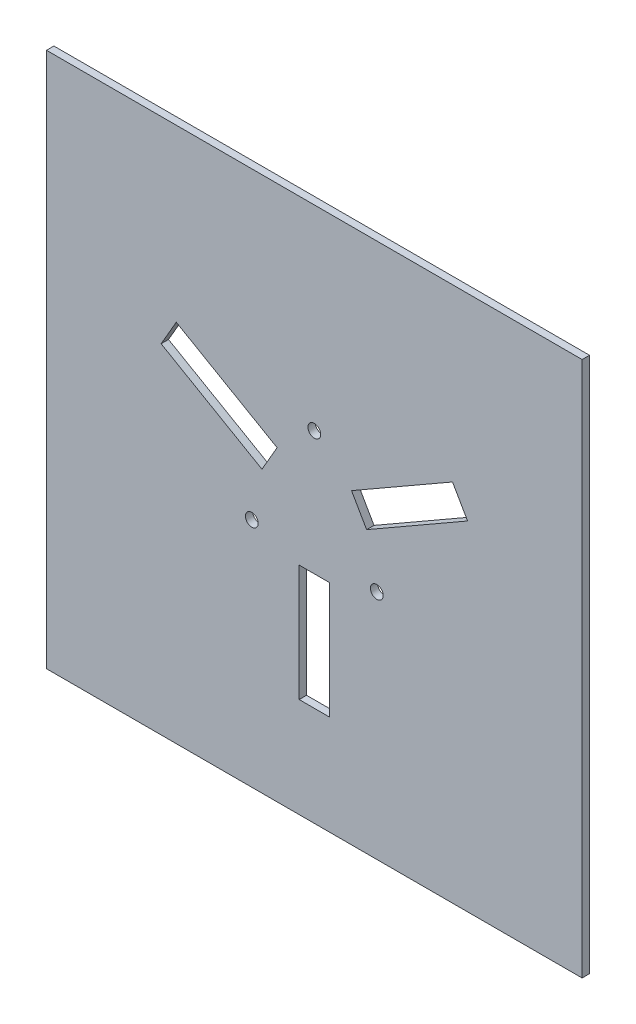
ISO-10303-21;
HEADER;
FILE_DESCRIPTION(('STEP AP214'),'2;1');
FILE_NAME('part.step','',(''),(''),'','','');
FILE_SCHEMA(('AUTOMOTIVE_DESIGN { 1 0 10303 214 1 1 1 1 }'));
ENDSEC;
DATA;
#1=APPLICATION_CONTEXT('core data for automotive mechanical design processes');
#2=APPLICATION_PROTOCOL_DEFINITION('international standard','automotive_design',2000,#1);
#3=PRODUCT_CONTEXT('',#1,'mechanical');
#4=PRODUCT('Part','Part','',(#3));
#5=PRODUCT_RELATED_PRODUCT_CATEGORY('part','',(#4));
#6=PRODUCT_DEFINITION_FORMATION('','',#4);
#7=PRODUCT_DEFINITION_CONTEXT('part definition',#1,'design');
#8=PRODUCT_DEFINITION('design','',#6,#7);
#9=PRODUCT_DEFINITION_SHAPE('','',#8);
#10=(LENGTH_UNIT() NAMED_UNIT(*) SI_UNIT(.MILLI.,.METRE.));
#11=(NAMED_UNIT(*) PLANE_ANGLE_UNIT() SI_UNIT($,.RADIAN.));
#12=(NAMED_UNIT(*) SI_UNIT($,.STERADIAN.) SOLID_ANGLE_UNIT());
#13=UNCERTAINTY_MEASURE_WITH_UNIT(LENGTH_MEASURE(1.E-05),#10,'distance_accuracy_value','');
#14=(GEOMETRIC_REPRESENTATION_CONTEXT(3) GLOBAL_UNCERTAINTY_ASSIGNED_CONTEXT((#13)) GLOBAL_UNIT_ASSIGNED_CONTEXT((#10,
#11,#12)) REPRESENTATION_CONTEXT('',''));
#15=CARTESIAN_POINT('',(0.,0.,0.));
#16=DIRECTION('',(0.,0.,1.));
#17=DIRECTION('',(1.,0.,0.));
#18=AXIS2_PLACEMENT_3D('',#15,#16,#17);
#19=CARTESIAN_POINT('',(115.,115.,0.));
#20=DIRECTION('',(0.,1.,0.));
#21=DIRECTION('',(0.,0.,1.));
#22=AXIS2_PLACEMENT_3D('',#19,#20,#21);
#23=PLANE('',#22);
#24=DIRECTION('',(-1.,0.,0.));
#25=VECTOR('',#24,1.);
#26=CARTESIAN_POINT('',(115.,115.,3.175));
#27=LINE('',#26,#25);
#28=CARTESIAN_POINT('',(115.,115.,3.175));
#29=VERTEX_POINT('',#28);
#30=CARTESIAN_POINT('',(-115.,115.,3.175));
#31=VERTEX_POINT('',#30);
#32=EDGE_CURVE('E260',#29,#31,#27,.T.);
#33=ORIENTED_EDGE('',*,*,#32,.F.);
#34=DIRECTION('',(0.,0.,1.));
#35=VECTOR('',#34,1.);
#36=CARTESIAN_POINT('',(115.,115.,0.));
#37=LINE('',#36,#35);
#38=CARTESIAN_POINT('',(115.,115.,0.));
#39=VERTEX_POINT('',#38);
#40=EDGE_CURVE('E11',#39,#29,#37,.T.);
#41=ORIENTED_EDGE('',*,*,#40,.F.);
#42=DIRECTION('',(-1.,0.,0.));
#43=VECTOR('',#42,1.);
#44=CARTESIAN_POINT('',(115.,115.,0.));
#45=LINE('',#44,#43);
#46=CARTESIAN_POINT('',(-115.,115.,0.));
#47=VERTEX_POINT('',#46);
#48=EDGE_CURVE('E267',#39,#47,#45,.T.);
#49=ORIENTED_EDGE('',*,*,#48,.T.);
#50=DIRECTION('',(0.,0.,1.));
#51=VECTOR('',#50,1.);
#52=CARTESIAN_POINT('',(-115.,115.,0.));
#53=LINE('',#52,#51);
#54=EDGE_CURVE('E38',#47,#31,#53,.T.);
#55=ORIENTED_EDGE('',*,*,#54,.T.);
#56=EDGE_LOOP('',(#33,#41,#49,#55));
#57=FACE_BOUND('',#56,.T.);
#58=ADVANCED_FACE('F35',(#57),#23,.T.);
#59=CARTESIAN_POINT('',(115.,-115.,0.));
#60=DIRECTION('',(1.,0.,0.));
#61=DIRECTION('',(0.,0.,-1.));
#62=AXIS2_PLACEMENT_3D('',#59,#60,#61);
#63=PLANE('',#62);
#64=DIRECTION('',(0.,1.,0.));
#65=VECTOR('',#64,1.);
#66=CARTESIAN_POINT('',(115.,-115.,3.175));
#67=LINE('',#66,#65);
#68=CARTESIAN_POINT('',(115.,-115.,3.175));
#69=VERTEX_POINT('',#68);
#70=EDGE_CURVE('E271',#69,#29,#67,.T.);
#71=ORIENTED_EDGE('',*,*,#70,.F.);
#72=DIRECTION('',(0.,0.,1.));
#73=VECTOR('',#72,1.);
#74=CARTESIAN_POINT('',(115.,-115.,0.));
#75=LINE('',#74,#73);
#76=CARTESIAN_POINT('',(115.,-115.,0.));
#77=VERTEX_POINT('',#76);
#78=EDGE_CURVE('E43',#77,#69,#75,.T.);
#79=ORIENTED_EDGE('',*,*,#78,.F.);
#80=DIRECTION('',(0.,1.,0.));
#81=VECTOR('',#80,1.);
#82=CARTESIAN_POINT('',(115.,-115.,0.));
#83=LINE('',#82,#81);
#84=EDGE_CURVE('E277',#77,#39,#83,.T.);
#85=ORIENTED_EDGE('',*,*,#84,.T.);
#86=ORIENTED_EDGE('',*,*,#40,.T.);
#87=EDGE_LOOP('',(#71,#79,#85,#86));
#88=FACE_BOUND('',#87,.T.);
#89=ADVANCED_FACE('F303',(#88),#63,.T.);
#90=CARTESIAN_POINT('',(-115.,-115.,0.));
#91=DIRECTION('',(0.,-1.,0.));
#92=DIRECTION('',(0.,0.,-1.));
#93=AXIS2_PLACEMENT_3D('',#90,#91,#92);
#94=PLANE('',#93);
#95=DIRECTION('',(1.,0.,0.));
#96=VECTOR('',#95,1.);
#97=CARTESIAN_POINT('',(-115.,-115.,3.175));
#98=LINE('',#97,#96);
#99=CARTESIAN_POINT('',(-115.,-115.,3.175));
#100=VERTEX_POINT('',#99);
#101=EDGE_CURVE('E285',#100,#69,#98,.T.);
#102=ORIENTED_EDGE('',*,*,#101,.F.);
#103=DIRECTION('',(0.,0.,1.));
#104=VECTOR('',#103,1.);
#105=CARTESIAN_POINT('',(-115.,-115.,0.));
#106=LINE('',#105,#104);
#107=CARTESIAN_POINT('',(-115.,-115.,0.));
#108=VERTEX_POINT('',#107);
#109=EDGE_CURVE('E290',#108,#100,#106,.T.);
#110=ORIENTED_EDGE('',*,*,#109,.F.);
#111=DIRECTION('',(1.,0.,0.));
#112=VECTOR('',#111,1.);
#113=CARTESIAN_POINT('',(-115.,-115.,0.));
#114=LINE('',#113,#112);
#115=EDGE_CURVE('E274',#108,#77,#114,.T.);
#116=ORIENTED_EDGE('',*,*,#115,.T.);
#117=ORIENTED_EDGE('',*,*,#78,.T.);
#118=EDGE_LOOP('',(#102,#110,#116,#117));
#119=FACE_BOUND('',#118,.T.);
#120=ADVANCED_FACE('F308',(#119),#94,.T.);
#121=CARTESIAN_POINT('',(-115.,115.,0.));
#122=DIRECTION('',(-1.,0.,0.));
#123=DIRECTION('',(0.,0.,1.));
#124=AXIS2_PLACEMENT_3D('',#121,#122,#123);
#125=PLANE('',#124);
#126=DIRECTION('',(0.,-1.,0.));
#127=VECTOR('',#126,1.);
#128=CARTESIAN_POINT('',(-115.,115.,3.175));
#129=LINE('',#128,#127);
#130=EDGE_CURVE('E282',#31,#100,#129,.T.);
#131=ORIENTED_EDGE('',*,*,#130,.F.);
#132=ORIENTED_EDGE('',*,*,#54,.F.);
#133=DIRECTION('',(0.,-1.,0.));
#134=VECTOR('',#133,1.);
#135=CARTESIAN_POINT('',(-115.,115.,0.));
#136=LINE('',#135,#134);
#137=EDGE_CURVE('E270',#47,#108,#136,.T.);
#138=ORIENTED_EDGE('',*,*,#137,.T.);
#139=ORIENTED_EDGE('',*,*,#109,.T.);
#140=EDGE_LOOP('',(#131,#132,#138,#139));
#141=FACE_BOUND('',#140,.T.);
#142=ADVANCED_FACE('F298',(#141),#125,.T.);
#143=CARTESIAN_POINT('',(0.,0.,0.));
#144=DIRECTION('',(0.,0.,1.));
#145=DIRECTION('',(1.,0.,0.));
#146=AXIS2_PLACEMENT_3D('',#143,#144,#145);
#147=PLANE('',#146);
#148=DIRECTION('',(-0.499999999999994,-0.866025403784443,0.));
#149=VECTOR('',#148,1.);
#150=CARTESIAN_POINT('',(-65.7765723080814,30.4705682289766,0.));
#151=LINE('',#150,#149);
#152=CARTESIAN_POINT('',(-59.2765723080814,41.7288984781744,0.));
#153=VERTEX_POINT('',#152);
#154=CARTESIAN_POINT('',(-65.7765723080814,30.4705682289766,0.));
#155=VERTEX_POINT('',#154);
#156=EDGE_CURVE('E156',#153,#155,#151,.T.);
#157=ORIENTED_EDGE('',*,*,#156,.T.);
#158=DIRECTION('',(0.866025403784439,-0.5,0.));
#159=VECTOR('',#158,1.);
#160=CARTESIAN_POINT('',(-22.4757639640145,5.47083487540115,0.));
#161=LINE('',#160,#159);
#162=CARTESIAN_POINT('',(-22.4757639640145,5.47083487540115,0.));
#163=VERTEX_POINT('',#162);
#164=EDGE_CURVE('E150',#155,#163,#161,.T.);
#165=ORIENTED_EDGE('',*,*,#164,.T.);
#166=DIRECTION('',(0.500000000000002,0.866025403784438,0.));
#167=VECTOR('',#166,1.);
#168=CARTESIAN_POINT('',(-15.9757639640145,16.7291651245988,0.));
#169=LINE('',#168,#167);
#170=CARTESIAN_POINT('',(-15.9757639640145,16.7291651245988,0.));
#171=VERTEX_POINT('',#170);
#172=EDGE_CURVE('E159',#163,#171,#169,.T.);
#173=ORIENTED_EDGE('',*,*,#172,.T.);
#174=DIRECTION('',(-0.866025403784437,0.500000000000002,0.));
#175=VECTOR('',#174,1.);
#176=CARTESIAN_POINT('',(-59.2765723080814,41.7288984781744,0.));
#177=LINE('',#176,#175);
#178=EDGE_CURVE('E51',#171,#153,#177,.T.);
#179=ORIENTED_EDGE('',*,*,#178,.T.);
#180=EDGE_LOOP('',(#157,#165,#173,#179));
#181=FACE_BOUND('',#180,.T.);
#182=CARTESIAN_POINT('',(0.,31.0007360703594,0.));
#183=DIRECTION('',(0.,0.,1.));
#184=DIRECTION('',(-1.,0.,0.));
#185=AXIS2_PLACEMENT_3D('',#182,#183,#184);
#186=CIRCLE('',#185,2.75);
#187=CARTESIAN_POINT('',(-2.75,31.0007360703594,0.));
#188=VERTEX_POINT('',#187);
#189=EDGE_CURVE('E185',#188,#188,#186,.T.);
#190=ORIENTED_EDGE('',*,*,#189,.T.);
#191=EDGE_LOOP('',(#190));
#192=FACE_BOUND('',#191,.T.);
#193=DIRECTION('',(-0.867195294962218,-0.497968192152261,0.));
#194=VECTOR('',#193,1.);
#195=CARTESIAN_POINT('',(15.9889707150248,16.7367694172548,0.));
#196=LINE('',#195,#194);
#197=CARTESIAN_POINT('',(59.348272994086,41.6349134619918,0.));
#198=VERTEX_POINT('',#197);
#199=CARTESIAN_POINT('',(15.9889707150248,16.7367694172548,0.));
#200=VERTEX_POINT('',#199);
#201=EDGE_CURVE('E201',#198,#200,#196,.T.);
#202=ORIENTED_EDGE('',*,*,#201,.T.);
#203=DIRECTION('',(0.497968192152261,-0.867195294962218,0.));
#204=VECTOR('',#203,1.);
#205=CARTESIAN_POINT('',(22.4625572130043,5.46323058274572,0.));
#206=LINE('',#205,#204);
#207=CARTESIAN_POINT('',(22.4625572130043,5.46323058274572,0.));
#208=VERTEX_POINT('',#207);
#209=EDGE_CURVE('E191',#200,#208,#206,.T.);
#210=ORIENTED_EDGE('',*,*,#209,.T.);
#211=DIRECTION('',(0.867195294962218,0.497968192152261,0.));
#212=VECTOR('',#211,1.);
#213=CARTESIAN_POINT('',(65.8218594920656,30.3613746274828,0.));
#214=LINE('',#213,#212);
#215=CARTESIAN_POINT('',(65.8218594920656,30.3613746274828,0.));
#216=VERTEX_POINT('',#215);
#217=EDGE_CURVE('E194',#208,#216,#214,.T.);
#218=ORIENTED_EDGE('',*,*,#217,.T.);
#219=DIRECTION('',(-0.497968192152262,0.867195294962218,0.));
#220=VECTOR('',#219,1.);
#221=CARTESIAN_POINT('',(59.348272994086,41.6349134619918,0.));
#222=LINE('',#221,#220);
#223=EDGE_CURVE('E198',#216,#198,#222,.T.);
#224=ORIENTED_EDGE('',*,*,#223,.T.);
#225=EDGE_LOOP('',(#202,#210,#218,#224));
#226=FACE_BOUND('',#225,.T.);
#227=CARTESIAN_POINT('',(26.8474249729478,-15.5003680351797,0.));
#228=DIRECTION('',(0.,0.,1.));
#229=DIRECTION('',(-1.,0.,0.));
#230=AXIS2_PLACEMENT_3D('',#227,#228,#229);
#231=CIRCLE('',#230,2.75);
#232=CARTESIAN_POINT('',(24.0974249729478,-15.5003680351797,0.));
#233=VERTEX_POINT('',#232);
#234=EDGE_CURVE('E223',#233,#233,#231,.T.);
#235=ORIENTED_EDGE('',*,*,#234,.T.);
#236=EDGE_LOOP('',(#235));
#237=FACE_BOUND('',#236,.T.);
#238=CARTESIAN_POINT('',(-26.8474249729478,-15.5003680351797,0.));
#239=DIRECTION('',(0.,0.,1.));
#240=DIRECTION('',(-1.,0.,0.));
#241=AXIS2_PLACEMENT_3D('',#238,#239,#240);
#242=CIRCLE('',#241,2.75);
#243=CARTESIAN_POINT('',(-29.5974249729478,-15.5003680351797,0.));
#244=VERTEX_POINT('',#243);
#245=EDGE_CURVE('E229',#244,#244,#242,.T.);
#246=ORIENTED_EDGE('',*,*,#245,.T.);
#247=EDGE_LOOP('',(#246));
#248=FACE_BOUND('',#247,.T.);
#249=DIRECTION('',(-1.,0.,0.));
#250=VECTOR('',#249,1.);
#251=CARTESIAN_POINT('',(-6.5,-22.2,0.));
#252=LINE('',#251,#250);
#253=CARTESIAN_POINT('',(6.5,-22.2,0.));
#254=VERTEX_POINT('',#253);
#255=CARTESIAN_POINT('',(-6.5,-22.2,0.));
#256=VERTEX_POINT('',#255);
#257=EDGE_CURVE('E245',#254,#256,#252,.T.);
#258=ORIENTED_EDGE('',*,*,#257,.T.);
#259=DIRECTION('',(0.,-1.,0.));
#260=VECTOR('',#259,1.);
#261=CARTESIAN_POINT('',(-6.49999999999999,-72.1994667071508,0.));
#262=LINE('',#261,#260);
#263=CARTESIAN_POINT('',(-6.49999999999999,-72.1994667071508,0.));
#264=VERTEX_POINT('',#263);
#265=EDGE_CURVE('E235',#256,#264,#262,.T.);
#266=ORIENTED_EDGE('',*,*,#265,.T.);
#267=DIRECTION('',(1.,0.,0.));
#268=VECTOR('',#267,1.);
#269=CARTESIAN_POINT('',(6.50000000000001,-72.1994667071508,0.));
#270=LINE('',#269,#268);
#271=CARTESIAN_POINT('',(6.50000000000001,-72.1994667071508,0.));
#272=VERTEX_POINT('',#271);
#273=EDGE_CURVE('E238',#264,#272,#270,.T.);
#274=ORIENTED_EDGE('',*,*,#273,.T.);
#275=DIRECTION('',(0.,1.,0.));
#276=VECTOR('',#275,1.);
#277=CARTESIAN_POINT('',(6.5,-22.2,0.));
#278=LINE('',#277,#276);
#279=EDGE_CURVE('E242',#272,#254,#278,.T.);
#280=ORIENTED_EDGE('',*,*,#279,.T.);
#281=EDGE_LOOP('',(#258,#266,#274,#280));
#282=FACE_BOUND('',#281,.T.);
#283=ORIENTED_EDGE('',*,*,#48,.F.);
#284=ORIENTED_EDGE('',*,*,#84,.F.);
#285=ORIENTED_EDGE('',*,*,#115,.F.);
#286=ORIENTED_EDGE('',*,*,#137,.F.);
#287=EDGE_LOOP('',(#283,#284,#285,#286));
#288=FACE_BOUND('',#287,.T.);
#289=ADVANCED_FACE('F163',(#181,#192,#226,#237,#248,#282,#288),#147,.F.);
#290=CARTESIAN_POINT('',(0.,0.,3.175));
#291=DIRECTION('',(0.,0.,1.));
#292=DIRECTION('',(1.,0.,0.));
#293=AXIS2_PLACEMENT_3D('',#290,#291,#292);
#294=PLANE('',#293);
#295=DIRECTION('',(0.866025403784439,-0.5,0.));
#296=VECTOR('',#295,1.);
#297=CARTESIAN_POINT('',(-22.4757639640145,5.47083487540115,3.175));
#298=LINE('',#297,#296);
#299=CARTESIAN_POINT('',(-65.7765723080814,30.4705682289766,3.175));
#300=VERTEX_POINT('',#299);
#301=CARTESIAN_POINT('',(-22.4757639640145,5.47083487540115,3.175));
#302=VERTEX_POINT('',#301);
#303=EDGE_CURVE('E59',#300,#302,#298,.T.);
#304=ORIENTED_EDGE('',*,*,#303,.F.);
#305=DIRECTION('',(-0.499999999999994,-0.866025403784443,0.));
#306=VECTOR('',#305,1.);
#307=CARTESIAN_POINT('',(-65.7765723080814,30.4705682289766,3.175));
#308=LINE('',#307,#306);
#309=CARTESIAN_POINT('',(-59.2765723080814,41.7288984781744,3.175));
#310=VERTEX_POINT('',#309);
#311=EDGE_CURVE('E166',#310,#300,#308,.T.);
#312=ORIENTED_EDGE('',*,*,#311,.F.);
#313=DIRECTION('',(-0.866025403784437,0.500000000000002,0.));
#314=VECTOR('',#313,1.);
#315=CARTESIAN_POINT('',(-59.2765723080814,41.7288984781744,3.175));
#316=LINE('',#315,#314);
#317=CARTESIAN_POINT('',(-15.9757639640145,16.7291651245988,3.175));
#318=VERTEX_POINT('',#317);
#319=EDGE_CURVE('E169',#318,#310,#316,.T.);
#320=ORIENTED_EDGE('',*,*,#319,.F.);
#321=DIRECTION('',(0.500000000000002,0.866025403784438,0.));
#322=VECTOR('',#321,1.);
#323=CARTESIAN_POINT('',(-15.9757639640145,16.7291651245988,3.175));
#324=LINE('',#323,#322);
#325=EDGE_CURVE('E175',#302,#318,#324,.T.);
#326=ORIENTED_EDGE('',*,*,#325,.F.);
#327=EDGE_LOOP('',(#304,#312,#320,#326));
#328=FACE_BOUND('',#327,.T.);
#329=CARTESIAN_POINT('',(0.,31.0007360703594,3.175));
#330=DIRECTION('',(0.,0.,1.));
#331=DIRECTION('',(-1.,0.,0.));
#332=AXIS2_PLACEMENT_3D('',#329,#330,#331);
#333=CIRCLE('',#332,2.75);
#334=CARTESIAN_POINT('',(-2.75,31.0007360703594,3.175));
#335=VERTEX_POINT('',#334);
#336=EDGE_CURVE('E181',#335,#335,#333,.T.);
#337=ORIENTED_EDGE('',*,*,#336,.F.);
#338=EDGE_LOOP('',(#337));
#339=FACE_BOUND('',#338,.T.);
#340=DIRECTION('',(0.497968192152261,-0.867195294962218,0.));
#341=VECTOR('',#340,1.);
#342=CARTESIAN_POINT('',(22.4625572130043,5.46323058274572,3.175));
#343=LINE('',#342,#341);
#344=CARTESIAN_POINT('',(15.9889707150248,16.7367694172548,3.175));
#345=VERTEX_POINT('',#344);
#346=CARTESIAN_POINT('',(22.4625572130043,5.46323058274572,3.175));
#347=VERTEX_POINT('',#346);
#348=EDGE_CURVE('E188',#345,#347,#343,.T.);
#349=ORIENTED_EDGE('',*,*,#348,.F.);
#350=DIRECTION('',(-0.867195294962218,-0.497968192152261,0.));
#351=VECTOR('',#350,1.);
#352=CARTESIAN_POINT('',(15.9889707150248,16.7367694172548,3.175));
#353=LINE('',#352,#351);
#354=CARTESIAN_POINT('',(59.348272994086,41.6349134619918,3.175));
#355=VERTEX_POINT('',#354);
#356=EDGE_CURVE('E195',#355,#345,#353,.T.);
#357=ORIENTED_EDGE('',*,*,#356,.F.);
#358=DIRECTION('',(-0.497968192152262,0.867195294962218,0.));
#359=VECTOR('',#358,1.);
#360=CARTESIAN_POINT('',(59.348272994086,41.6349134619918,3.175));
#361=LINE('',#360,#359);
#362=CARTESIAN_POINT('',(65.8218594920656,30.3613746274828,3.175));
#363=VERTEX_POINT('',#362);
#364=EDGE_CURVE('E209',#363,#355,#361,.T.);
#365=ORIENTED_EDGE('',*,*,#364,.F.);
#366=DIRECTION('',(0.867195294962218,0.497968192152261,0.));
#367=VECTOR('',#366,1.);
#368=CARTESIAN_POINT('',(65.8218594920656,30.3613746274828,3.175));
#369=LINE('',#368,#367);
#370=EDGE_CURVE('E206',#347,#363,#369,.T.);
#371=ORIENTED_EDGE('',*,*,#370,.F.);
#372=EDGE_LOOP('',(#349,#357,#365,#371));
#373=FACE_BOUND('',#372,.T.);
#374=CARTESIAN_POINT('',(26.8474249729478,-15.5003680351797,3.175));
#375=DIRECTION('',(0.,0.,1.));
#376=DIRECTION('',(-1.,0.,0.));
#377=AXIS2_PLACEMENT_3D('',#374,#375,#376);
#378=CIRCLE('',#377,2.75);
#379=CARTESIAN_POINT('',(24.0974249729478,-15.5003680351797,3.175));
#380=VERTEX_POINT('',#379);
#381=EDGE_CURVE('E216',#380,#380,#378,.T.);
#382=ORIENTED_EDGE('',*,*,#381,.F.);
#383=EDGE_LOOP('',(#382));
#384=FACE_BOUND('',#383,.T.);
#385=CARTESIAN_POINT('',(-26.8474249729478,-15.5003680351797,3.175));
#386=DIRECTION('',(0.,0.,1.));
#387=DIRECTION('',(-1.,0.,0.));
#388=AXIS2_PLACEMENT_3D('',#385,#386,#387);
#389=CIRCLE('',#388,2.75);
#390=CARTESIAN_POINT('',(-29.5974249729478,-15.5003680351797,3.175));
#391=VERTEX_POINT('',#390);
#392=EDGE_CURVE('E226',#391,#391,#389,.T.);
#393=ORIENTED_EDGE('',*,*,#392,.F.);
#394=EDGE_LOOP('',(#393));
#395=FACE_BOUND('',#394,.T.);
#396=DIRECTION('',(0.,-1.,0.));
#397=VECTOR('',#396,1.);
#398=CARTESIAN_POINT('',(-6.49999999999999,-72.1994667071508,3.175));
#399=LINE('',#398,#397);
#400=CARTESIAN_POINT('',(-6.5,-22.2,3.175));
#401=VERTEX_POINT('',#400);
#402=CARTESIAN_POINT('',(-6.49999999999999,-72.1994667071508,3.175));
#403=VERTEX_POINT('',#402);
#404=EDGE_CURVE('E232',#401,#403,#399,.T.);
#405=ORIENTED_EDGE('',*,*,#404,.F.);
#406=DIRECTION('',(-1.,0.,0.));
#407=VECTOR('',#406,1.);
#408=CARTESIAN_POINT('',(-6.5,-22.2,3.175));
#409=LINE('',#408,#407);
#410=CARTESIAN_POINT('',(6.5,-22.2,3.175));
#411=VERTEX_POINT('',#410);
#412=EDGE_CURVE('E239',#411,#401,#409,.T.);
#413=ORIENTED_EDGE('',*,*,#412,.F.);
#414=DIRECTION('',(0.,1.,0.));
#415=VECTOR('',#414,1.);
#416=CARTESIAN_POINT('',(6.5,-22.2,3.175));
#417=LINE('',#416,#415);
#418=CARTESIAN_POINT('',(6.50000000000001,-72.1994667071508,3.175));
#419=VERTEX_POINT('',#418);
#420=EDGE_CURVE('E253',#419,#411,#417,.T.);
#421=ORIENTED_EDGE('',*,*,#420,.F.);
#422=DIRECTION('',(1.,0.,0.));
#423=VECTOR('',#422,1.);
#424=CARTESIAN_POINT('',(6.50000000000001,-72.1994667071508,3.175));
#425=LINE('',#424,#423);
#426=EDGE_CURVE('E250',#403,#419,#425,.T.);
#427=ORIENTED_EDGE('',*,*,#426,.F.);
#428=EDGE_LOOP('',(#405,#413,#421,#427));
#429=FACE_BOUND('',#428,.T.);
#430=ORIENTED_EDGE('',*,*,#32,.T.);
#431=ORIENTED_EDGE('',*,*,#130,.T.);
#432=ORIENTED_EDGE('',*,*,#101,.T.);
#433=ORIENTED_EDGE('',*,*,#70,.T.);
#434=EDGE_LOOP('',(#430,#431,#432,#433));
#435=FACE_BOUND('',#434,.T.);
#436=ADVANCED_FACE('F300',(#328,#339,#373,#384,#395,#429,#435),#294,.T.);
#437=CARTESIAN_POINT('',(-6.49999999999999,-72.1994667071508,0.));
#438=DIRECTION('',(-1.,0.,0.));
#439=DIRECTION('',(0.,-1.,0.));
#440=AXIS2_PLACEMENT_3D('',#437,#438,#439);
#441=PLANE('',#440);
#442=ORIENTED_EDGE('',*,*,#404,.T.);
#443=DIRECTION('',(0.,0.,1.));
#444=VECTOR('',#443,1.);
#445=CARTESIAN_POINT('',(-6.49999999999999,-72.1994667071508,0.));
#446=LINE('',#445,#444);
#447=EDGE_CURVE('E248',#264,#403,#446,.T.);
#448=ORIENTED_EDGE('',*,*,#447,.F.);
#449=ORIENTED_EDGE('',*,*,#265,.F.);
#450=DIRECTION('',(0.,0.,1.));
#451=VECTOR('',#450,1.);
#452=CARTESIAN_POINT('',(-6.5,-22.2,0.));
#453=LINE('',#452,#451);
#454=EDGE_CURVE('E258',#256,#401,#453,.T.);
#455=ORIENTED_EDGE('',*,*,#454,.T.);
#456=EDGE_LOOP('',(#442,#448,#449,#455));
#457=FACE_BOUND('',#456,.T.);
#458=ADVANCED_FACE('F350',(#457),#441,.F.);
#459=CARTESIAN_POINT('',(-6.5,-22.2,0.));
#460=DIRECTION('',(0.,1.,0.));
#461=DIRECTION('',(-1.,0.,0.));
#462=AXIS2_PLACEMENT_3D('',#459,#460,#461);
#463=PLANE('',#462);
#464=ORIENTED_EDGE('',*,*,#412,.T.);
#465=ORIENTED_EDGE('',*,*,#454,.F.);
#466=ORIENTED_EDGE('',*,*,#257,.F.);
#467=DIRECTION('',(0.,0.,1.));
#468=VECTOR('',#467,1.);
#469=CARTESIAN_POINT('',(6.5,-22.2,0.));
#470=LINE('',#469,#468);
#471=EDGE_CURVE('E261',#254,#411,#470,.T.);
#472=ORIENTED_EDGE('',*,*,#471,.T.);
#473=EDGE_LOOP('',(#464,#465,#466,#472));
#474=FACE_BOUND('',#473,.T.);
#475=ADVANCED_FACE('F360',(#474),#463,.F.);
#476=CARTESIAN_POINT('',(6.5,-22.2,0.));
#477=DIRECTION('',(1.,0.,0.));
#478=DIRECTION('',(0.,1.,0.));
#479=AXIS2_PLACEMENT_3D('',#476,#477,#478);
#480=PLANE('',#479);
#481=ORIENTED_EDGE('',*,*,#420,.T.);
#482=ORIENTED_EDGE('',*,*,#471,.F.);
#483=ORIENTED_EDGE('',*,*,#279,.F.);
#484=DIRECTION('',(0.,0.,1.));
#485=VECTOR('',#484,1.);
#486=CARTESIAN_POINT('',(6.50000000000001,-72.1994667071508,0.));
#487=LINE('',#486,#485);
#488=EDGE_CURVE('E263',#272,#419,#487,.T.);
#489=ORIENTED_EDGE('',*,*,#488,.T.);
#490=EDGE_LOOP('',(#481,#482,#483,#489));
#491=FACE_BOUND('',#490,.T.);
#492=ADVANCED_FACE('F370',(#491),#480,.F.);
#493=CARTESIAN_POINT('',(6.50000000000001,-72.1994667071508,0.));
#494=DIRECTION('',(0.,-1.,0.));
#495=DIRECTION('',(0.,0.,-1.));
#496=AXIS2_PLACEMENT_3D('',#493,#494,#495);
#497=PLANE('',#496);
#498=ORIENTED_EDGE('',*,*,#426,.T.);
#499=ORIENTED_EDGE('',*,*,#488,.F.);
#500=ORIENTED_EDGE('',*,*,#273,.F.);
#501=ORIENTED_EDGE('',*,*,#447,.T.);
#502=EDGE_LOOP('',(#498,#499,#500,#501));
#503=FACE_BOUND('',#502,.T.);
#504=ADVANCED_FACE('F380',(#503),#497,.F.);
#505=CARTESIAN_POINT('',(-26.8474249729478,-15.5003680351797,0.));
#506=DIRECTION('',(0.,0.,1.));
#507=DIRECTION('',(1.,0.,0.));
#508=AXIS2_PLACEMENT_3D('',#505,#506,#507);
#509=CYLINDRICAL_SURFACE('',#508,2.75);
#510=ORIENTED_EDGE('',*,*,#245,.F.);
#511=EDGE_LOOP('',(#510));
#512=FACE_BOUND('',#511,.T.);
#513=ORIENTED_EDGE('',*,*,#392,.T.);
#514=EDGE_LOOP('',(#513));
#515=FACE_BOUND('',#514,.T.);
#516=ADVANCED_FACE('F390',(#512,#515),#509,.F.);
#517=CARTESIAN_POINT('',(26.8474249729478,-15.5003680351797,0.));
#518=DIRECTION('',(0.,0.,1.));
#519=DIRECTION('',(1.,0.,0.));
#520=AXIS2_PLACEMENT_3D('',#517,#518,#519);
#521=CYLINDRICAL_SURFACE('',#520,2.75);
#522=ORIENTED_EDGE('',*,*,#234,.F.);
#523=EDGE_LOOP('',(#522));
#524=FACE_BOUND('',#523,.T.);
#525=ORIENTED_EDGE('',*,*,#381,.T.);
#526=EDGE_LOOP('',(#525));
#527=FACE_BOUND('',#526,.T.);
#528=ADVANCED_FACE('F400',(#524,#527),#521,.F.);
#529=CARTESIAN_POINT('',(22.4625572130043,5.46323058274572,0.));
#530=DIRECTION('',(-0.867195294962218,-0.497968192152261,0.));
#531=DIRECTION('',(0.497968192152261,-0.867195294962218,0.));
#532=AXIS2_PLACEMENT_3D('',#529,#530,#531);
#533=PLANE('',#532);
#534=ORIENTED_EDGE('',*,*,#348,.T.);
#535=DIRECTION('',(0.,0.,1.));
#536=VECTOR('',#535,1.);
#537=CARTESIAN_POINT('',(22.4625572130043,5.46323058274572,0.));
#538=LINE('',#537,#536);
#539=EDGE_CURVE('E204',#208,#347,#538,.T.);
#540=ORIENTED_EDGE('',*,*,#539,.F.);
#541=ORIENTED_EDGE('',*,*,#209,.F.);
#542=DIRECTION('',(0.,0.,1.));
#543=VECTOR('',#542,1.);
#544=CARTESIAN_POINT('',(15.9889707150248,16.7367694172548,0.));
#545=LINE('',#544,#543);
#546=EDGE_CURVE('E214',#200,#345,#545,.T.);
#547=ORIENTED_EDGE('',*,*,#546,.T.);
#548=EDGE_LOOP('',(#534,#540,#541,#547));
#549=FACE_BOUND('',#548,.T.);
#550=ADVANCED_FACE('F410',(#549),#533,.F.);
#551=CARTESIAN_POINT('',(15.9889707150248,16.7367694172548,0.));
#552=DIRECTION('',(-0.497968192152262,0.867195294962218,0.));
#553=DIRECTION('',(-0.867195294962218,-0.497968192152262,0.));
#554=AXIS2_PLACEMENT_3D('',#551,#552,#553);
#555=PLANE('',#554);
#556=ORIENTED_EDGE('',*,*,#356,.T.);
#557=ORIENTED_EDGE('',*,*,#546,.F.);
#558=ORIENTED_EDGE('',*,*,#201,.F.);
#559=DIRECTION('',(0.,0.,1.));
#560=VECTOR('',#559,1.);
#561=CARTESIAN_POINT('',(59.348272994086,41.6349134619918,0.));
#562=LINE('',#561,#560);
#563=EDGE_CURVE('E217',#198,#355,#562,.T.);
#564=ORIENTED_EDGE('',*,*,#563,.T.);
#565=EDGE_LOOP('',(#556,#557,#558,#564));
#566=FACE_BOUND('',#565,.T.);
#567=ADVANCED_FACE('F420',(#566),#555,.F.);
#568=CARTESIAN_POINT('',(59.348272994086,41.6349134619918,0.));
#569=DIRECTION('',(0.867195294962218,0.497968192152262,0.));
#570=DIRECTION('',(-0.497968192152262,0.867195294962218,0.));
#571=AXIS2_PLACEMENT_3D('',#568,#569,#570);
#572=PLANE('',#571);
#573=ORIENTED_EDGE('',*,*,#364,.T.);
#574=ORIENTED_EDGE('',*,*,#563,.F.);
#575=ORIENTED_EDGE('',*,*,#223,.F.);
#576=DIRECTION('',(0.,0.,1.));
#577=VECTOR('',#576,1.);
#578=CARTESIAN_POINT('',(65.8218594920656,30.3613746274828,0.));
#579=LINE('',#578,#577);
#580=EDGE_CURVE('E219',#216,#363,#579,.T.);
#581=ORIENTED_EDGE('',*,*,#580,.T.);
#582=EDGE_LOOP('',(#573,#574,#575,#581));
#583=FACE_BOUND('',#582,.T.);
#584=ADVANCED_FACE('F430',(#583),#572,.F.);
#585=CARTESIAN_POINT('',(65.8218594920656,30.3613746274828,0.));
#586=DIRECTION('',(0.497968192152261,-0.867195294962218,0.));
#587=DIRECTION('',(0.867195294962218,0.497968192152261,0.));
#588=AXIS2_PLACEMENT_3D('',#585,#586,#587);
#589=PLANE('',#588);
#590=ORIENTED_EDGE('',*,*,#370,.T.);
#591=ORIENTED_EDGE('',*,*,#580,.F.);
#592=ORIENTED_EDGE('',*,*,#217,.F.);
#593=ORIENTED_EDGE('',*,*,#539,.T.);
#594=EDGE_LOOP('',(#590,#591,#592,#593));
#595=FACE_BOUND('',#594,.T.);
#596=ADVANCED_FACE('F440',(#595),#589,.F.);
#597=CARTESIAN_POINT('',(0.,31.0007360703594,0.));
#598=DIRECTION('',(0.,0.,1.));
#599=DIRECTION('',(1.,0.,0.));
#600=AXIS2_PLACEMENT_3D('',#597,#598,#599);
#601=CYLINDRICAL_SURFACE('',#600,2.75);
#602=ORIENTED_EDGE('',*,*,#189,.F.);
#603=EDGE_LOOP('',(#602));
#604=FACE_BOUND('',#603,.T.);
#605=ORIENTED_EDGE('',*,*,#336,.T.);
#606=EDGE_LOOP('',(#605));
#607=FACE_BOUND('',#606,.T.);
#608=ADVANCED_FACE('F450',(#604,#607),#601,.F.);
#609=CARTESIAN_POINT('',(-22.4757639640145,5.47083487540115,0.));
#610=DIRECTION('',(-0.5,-0.866025403784439,0.));
#611=DIRECTION('',(0.866025403784439,-0.5,0.));
#612=AXIS2_PLACEMENT_3D('',#609,#610,#611);
#613=PLANE('',#612);
#614=ORIENTED_EDGE('',*,*,#303,.T.);
#615=DIRECTION('',(0.,0.,1.));
#616=VECTOR('',#615,1.);
#617=CARTESIAN_POINT('',(-22.4757639640145,5.47083487540115,0.));
#618=LINE('',#617,#616);
#619=EDGE_CURVE('E146',#163,#302,#618,.T.);
#620=ORIENTED_EDGE('',*,*,#619,.F.);
#621=ORIENTED_EDGE('',*,*,#164,.F.);
#622=DIRECTION('',(0.,0.,1.));
#623=VECTOR('',#622,1.);
#624=CARTESIAN_POINT('',(-65.7765723080814,30.4705682289766,0.));
#625=LINE('',#624,#623);
#626=EDGE_CURVE('E179',#155,#300,#625,.T.);
#627=ORIENTED_EDGE('',*,*,#626,.T.);
#628=EDGE_LOOP('',(#614,#620,#621,#627));
#629=FACE_BOUND('',#628,.T.);
#630=ADVANCED_FACE('F148',(#629),#613,.F.);
#631=CARTESIAN_POINT('',(-65.7765723080814,30.4705682289766,0.));
#632=DIRECTION('',(-0.866025403784442,0.499999999999994,0.));
#633=DIRECTION('',(-0.499999999999994,-0.866025403784442,0.));
#634=AXIS2_PLACEMENT_3D('',#631,#632,#633);
#635=PLANE('',#634);
#636=ORIENTED_EDGE('',*,*,#311,.T.);
#637=ORIENTED_EDGE('',*,*,#626,.F.);
#638=ORIENTED_EDGE('',*,*,#156,.F.);
#639=DIRECTION('',(0.,0.,1.));
#640=VECTOR('',#639,1.);
#641=CARTESIAN_POINT('',(-59.2765723080814,41.7288984781744,0.));
#642=LINE('',#641,#640);
#643=EDGE_CURVE('E182',#153,#310,#642,.T.);
#644=ORIENTED_EDGE('',*,*,#643,.T.);
#645=EDGE_LOOP('',(#636,#637,#638,#644));
#646=FACE_BOUND('',#645,.T.);
#647=ADVANCED_FACE('F469',(#646),#635,.F.);
#648=CARTESIAN_POINT('',(-59.2765723080814,41.7288984781744,0.));
#649=DIRECTION('',(0.500000000000002,0.866025403784437,0.));
#650=DIRECTION('',(-0.866025403784438,0.500000000000002,0.));
#651=AXIS2_PLACEMENT_3D('',#648,#649,#650);
#652=PLANE('',#651);
#653=ORIENTED_EDGE('',*,*,#319,.T.);
#654=ORIENTED_EDGE('',*,*,#643,.F.);
#655=ORIENTED_EDGE('',*,*,#178,.F.);
#656=DIRECTION('',(0.,0.,1.));
#657=VECTOR('',#656,1.);
#658=CARTESIAN_POINT('',(-15.9757639640145,16.7291651245988,0.));
#659=LINE('',#658,#657);
#660=EDGE_CURVE('E155',#171,#318,#659,.T.);
#661=ORIENTED_EDGE('',*,*,#660,.T.);
#662=EDGE_LOOP('',(#653,#654,#655,#661));
#663=FACE_BOUND('',#662,.T.);
#664=ADVANCED_FACE('F478',(#663),#652,.F.);
#665=CARTESIAN_POINT('',(-15.9757639640145,16.7291651245988,0.));
#666=DIRECTION('',(0.866025403784438,-0.500000000000002,0.));
#667=DIRECTION('',(0.500000000000002,0.866025403784438,0.));
#668=AXIS2_PLACEMENT_3D('',#665,#666,#667);
#669=PLANE('',#668);
#670=ORIENTED_EDGE('',*,*,#325,.T.);
#671=ORIENTED_EDGE('',*,*,#660,.F.);
#672=ORIENTED_EDGE('',*,*,#172,.F.);
#673=ORIENTED_EDGE('',*,*,#619,.T.);
#674=EDGE_LOOP('',(#670,#671,#672,#673));
#675=FACE_BOUND('',#674,.T.);
#676=ADVANCED_FACE('F160',(#675),#669,.F.);
#677=CLOSED_SHELL('',(#58,#89,#120,#142,#289,#436,#458,#475,#492,#504,#516,#528,#550,#567,#584,
#596,#608,#630,#647,#664,#676));
#678=MANIFOLD_SOLID_BREP('B2',#677);
#679=ADVANCED_BREP_SHAPE_REPRESENTATION('',(#18,#678),#14);
#680=SHAPE_DEFINITION_REPRESENTATION(#9,#679);
ENDSEC;
END-ISO-10303-21;
